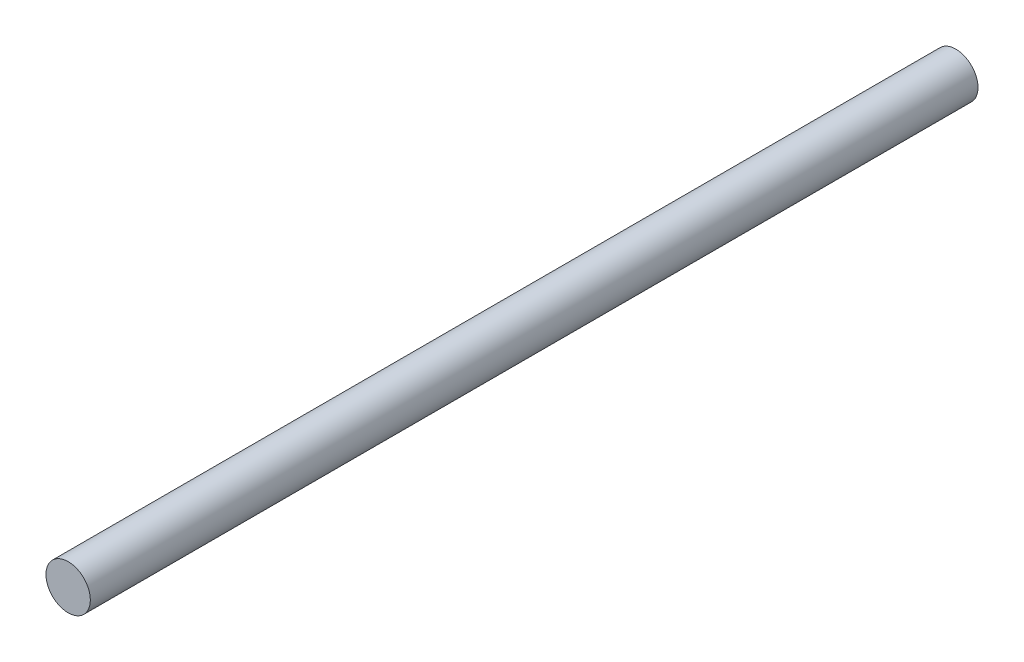
ISO-10303-21;
HEADER;
FILE_DESCRIPTION(('STEP AP214'),'2;1');
FILE_NAME('part.step','',(''),(''),'','','');
FILE_SCHEMA(('AUTOMOTIVE_DESIGN { 1 0 10303 214 1 1 1 1 }'));
ENDSEC;
DATA;
#1=APPLICATION_CONTEXT('core data for automotive mechanical design processes');
#2=APPLICATION_PROTOCOL_DEFINITION('international standard','automotive_design',2000,#1);
#3=PRODUCT_CONTEXT('',#1,'mechanical');
#4=PRODUCT('Part','Part','',(#3));
#5=PRODUCT_RELATED_PRODUCT_CATEGORY('part','',(#4));
#6=PRODUCT_DEFINITION_FORMATION('','',#4);
#7=PRODUCT_DEFINITION_CONTEXT('part definition',#1,'design');
#8=PRODUCT_DEFINITION('design','',#6,#7);
#9=PRODUCT_DEFINITION_SHAPE('','',#8);
#10=(LENGTH_UNIT() NAMED_UNIT(*) SI_UNIT(.MILLI.,.METRE.));
#11=(NAMED_UNIT(*) PLANE_ANGLE_UNIT() SI_UNIT($,.RADIAN.));
#12=(NAMED_UNIT(*) SI_UNIT($,.STERADIAN.) SOLID_ANGLE_UNIT());
#13=UNCERTAINTY_MEASURE_WITH_UNIT(LENGTH_MEASURE(1.E-05),#10,'distance_accuracy_value','');
#14=(GEOMETRIC_REPRESENTATION_CONTEXT(3) GLOBAL_UNCERTAINTY_ASSIGNED_CONTEXT((#13)) GLOBAL_UNIT_ASSIGNED_CONTEXT((#10,
#11,#12)) REPRESENTATION_CONTEXT('',''));
#15=CARTESIAN_POINT('',(0.,0.,0.));
#16=DIRECTION('',(0.,0.,1.));
#17=DIRECTION('',(1.,0.,0.));
#18=AXIS2_PLACEMENT_3D('',#15,#16,#17);
#19=CARTESIAN_POINT('',(0.,0.,160.));
#20=DIRECTION('',(0.,0.,-1.));
#21=DIRECTION('',(-1.,0.,0.));
#22=AXIS2_PLACEMENT_3D('',#19,#20,#21);
#23=CYLINDRICAL_SURFACE('',#22,4.);
#24=CARTESIAN_POINT('',(0.,0.,160.));
#25=DIRECTION('',(0.,0.,1.));
#26=DIRECTION('',(1.,0.,0.));
#27=AXIS2_PLACEMENT_3D('',#24,#25,#26);
#28=CIRCLE('',#27,4.);
#29=CARTESIAN_POINT('',(4.,0.,160.));
#30=VERTEX_POINT('',#29);
#31=EDGE_CURVE('E10',#30,#30,#28,.T.);
#32=ORIENTED_EDGE('',*,*,#31,.F.);
#33=EDGE_LOOP('',(#32));
#34=FACE_BOUND('',#33,.T.);
#35=CARTESIAN_POINT('',(0.,0.,0.));
#36=DIRECTION('',(0.,0.,1.));
#37=DIRECTION('',(1.,0.,0.));
#38=AXIS2_PLACEMENT_3D('',#35,#36,#37);
#39=CIRCLE('',#38,4.);
#40=CARTESIAN_POINT('',(4.,0.,0.));
#41=VERTEX_POINT('',#40);
#42=EDGE_CURVE('E40',#41,#41,#39,.T.);
#43=ORIENTED_EDGE('',*,*,#42,.T.);
#44=EDGE_LOOP('',(#43));
#45=FACE_BOUND('',#44,.T.);
#46=ADVANCED_FACE('F37',(#34,#45),#23,.T.);
#47=CARTESIAN_POINT('',(0.,0.,160.));
#48=DIRECTION('',(0.,0.,1.));
#49=DIRECTION('',(1.,0.,0.));
#50=AXIS2_PLACEMENT_3D('',#47,#48,#49);
#51=PLANE('',#50);
#52=ORIENTED_EDGE('',*,*,#31,.T.);
#53=EDGE_LOOP('',(#52));
#54=FACE_BOUND('',#53,.T.);
#55=ADVANCED_FACE('F54',(#54),#51,.T.);
#56=CARTESIAN_POINT('',(0.,0.,0.));
#57=DIRECTION('',(0.,0.,1.));
#58=DIRECTION('',(1.,0.,0.));
#59=AXIS2_PLACEMENT_3D('',#56,#57,#58);
#60=PLANE('',#59);
#61=ORIENTED_EDGE('',*,*,#42,.F.);
#62=EDGE_LOOP('',(#61));
#63=FACE_BOUND('',#62,.T.);
#64=ADVANCED_FACE('F52',(#63),#60,.F.);
#65=CLOSED_SHELL('',(#46,#55,#64));
#66=MANIFOLD_SOLID_BREP('B2',#65);
#67=ADVANCED_BREP_SHAPE_REPRESENTATION('',(#18,#66),#14);
#68=SHAPE_DEFINITION_REPRESENTATION(#9,#67);
ENDSEC;
END-ISO-10303-21;
